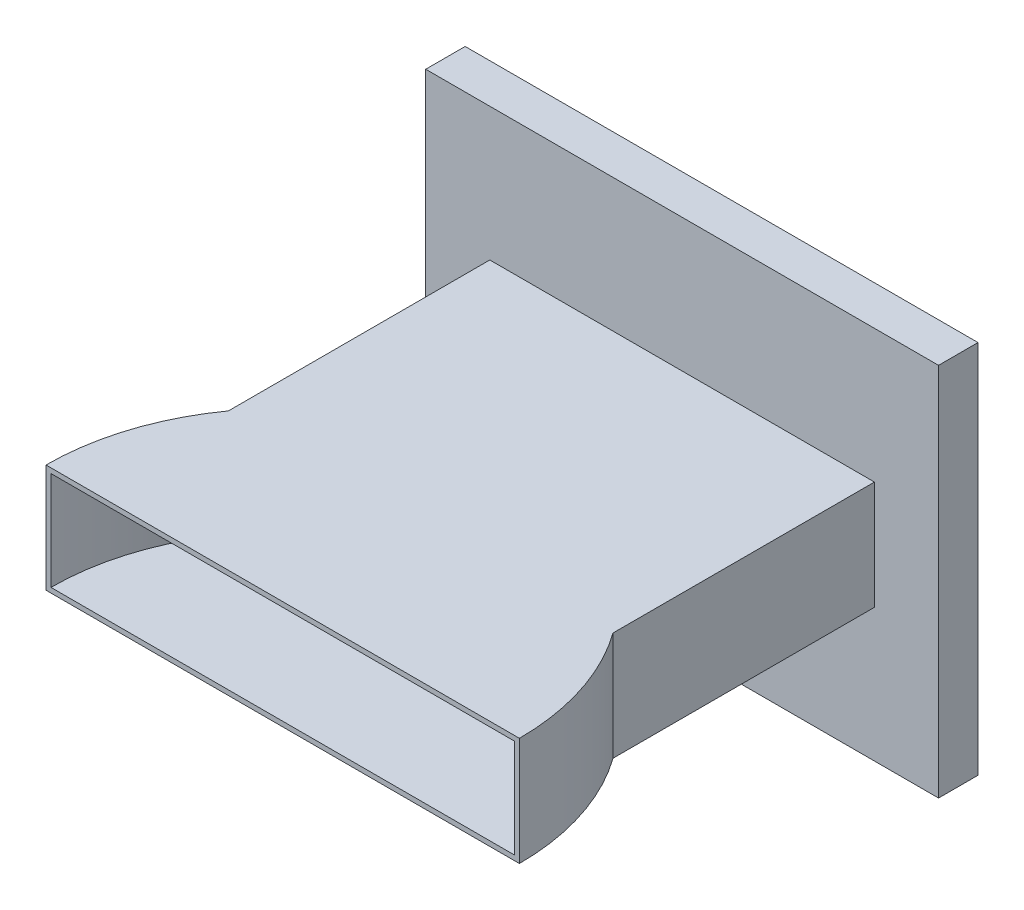
ISO-10303-21;
HEADER;
FILE_DESCRIPTION(('STEP AP214'),'2;1');
FILE_NAME('part.step','',(''),(''),'','','');
FILE_SCHEMA(('AUTOMOTIVE_DESIGN { 1 0 10303 214 1 1 1 1 }'));
ENDSEC;
DATA;
#1=APPLICATION_CONTEXT('core data for automotive mechanical design processes');
#2=APPLICATION_PROTOCOL_DEFINITION('international standard','automotive_design',2000,#1);
#3=PRODUCT_CONTEXT('',#1,'mechanical');
#4=PRODUCT('Part','Part','',(#3));
#5=PRODUCT_RELATED_PRODUCT_CATEGORY('part','',(#4));
#6=PRODUCT_DEFINITION_FORMATION('','',#4);
#7=PRODUCT_DEFINITION_CONTEXT('part definition',#1,'design');
#8=PRODUCT_DEFINITION('design','',#6,#7);
#9=PRODUCT_DEFINITION_SHAPE('','',#8);
#10=(LENGTH_UNIT() NAMED_UNIT(*) SI_UNIT(.MILLI.,.METRE.));
#11=(NAMED_UNIT(*) PLANE_ANGLE_UNIT() SI_UNIT($,.RADIAN.));
#12=(NAMED_UNIT(*) SI_UNIT($,.STERADIAN.) SOLID_ANGLE_UNIT());
#13=UNCERTAINTY_MEASURE_WITH_UNIT(LENGTH_MEASURE(1.E-05),#10,'distance_accuracy_value','');
#14=(GEOMETRIC_REPRESENTATION_CONTEXT(3) GLOBAL_UNCERTAINTY_ASSIGNED_CONTEXT((#13)) GLOBAL_UNIT_ASSIGNED_CONTEXT((#10,
#11,#12)) REPRESENTATION_CONTEXT('',''));
#15=CARTESIAN_POINT('',(0.,0.,0.));
#16=DIRECTION('',(0.,0.,1.));
#17=DIRECTION('',(1.,0.,0.));
#18=AXIS2_PLACEMENT_3D('',#15,#16,#17);
#19=CARTESIAN_POINT('',(0.,0.,243.));
#20=DIRECTION('',(0.,0.,1.));
#21=DIRECTION('',(1.,0.,0.));
#22=AXIS2_PLACEMENT_3D('',#19,#20,#21);
#23=PLANE('',#22);
#24=DIRECTION('',(1.,0.,0.));
#25=VECTOR('',#24,1.);
#26=CARTESIAN_POINT('',(0.,0.,243.));
#27=LINE('',#26,#25);
#28=CARTESIAN_POINT('',(-27.,0.,243.));
#29=VERTEX_POINT('',#28);
#30=CARTESIAN_POINT('',(261.,0.,243.));
#31=VERTEX_POINT('',#30);
#32=EDGE_CURVE('E286',#29,#31,#27,.T.);
#33=ORIENTED_EDGE('',*,*,#32,.T.);
#34=DIRECTION('',(0.,-1.,0.));
#35=VECTOR('',#34,1.);
#36=CARTESIAN_POINT('',(261.,66.,243.));
#37=LINE('',#36,#35);
#38=CARTESIAN_POINT('',(261.,66.,243.));
#39=VERTEX_POINT('',#38);
#40=EDGE_CURVE('E222',#39,#31,#37,.T.);
#41=ORIENTED_EDGE('',*,*,#40,.F.);
#42=DIRECTION('',(-1.,0.,0.));
#43=VECTOR('',#42,1.);
#44=CARTESIAN_POINT('',(234.,66.,243.));
#45=LINE('',#44,#43);
#46=CARTESIAN_POINT('',(-27.,66.,243.));
#47=VERTEX_POINT('',#46);
#48=EDGE_CURVE('E283',#39,#47,#45,.T.);
#49=ORIENTED_EDGE('',*,*,#48,.T.);
#50=DIRECTION('',(0.,-1.,0.));
#51=VECTOR('',#50,1.);
#52=CARTESIAN_POINT('',(-27.,66.,243.));
#53=LINE('',#52,#51);
#54=EDGE_CURVE('E227',#47,#29,#53,.T.);
#55=ORIENTED_EDGE('',*,*,#54,.T.);
#56=EDGE_LOOP('',(#33,#41,#49,#55));
#57=FACE_BOUND('',#56,.T.);
#58=DIRECTION('',(0.,1.,0.));
#59=VECTOR('',#58,1.);
#60=CARTESIAN_POINT('',(-24.,63.,243.));
#61=LINE('',#60,#59);
#62=CARTESIAN_POINT('',(-24.,3.00000000000001,243.));
#63=VERTEX_POINT('',#62);
#64=CARTESIAN_POINT('',(-24.,63.,243.));
#65=VERTEX_POINT('',#64);
#66=EDGE_CURVE('E325',#63,#65,#61,.T.);
#67=ORIENTED_EDGE('',*,*,#66,.T.);
#68=DIRECTION('',(1.,0.,0.));
#69=VECTOR('',#68,1.);
#70=CARTESIAN_POINT('',(0.,63.,243.));
#71=LINE('',#70,#69);
#72=CARTESIAN_POINT('',(258.,63.,243.));
#73=VERTEX_POINT('',#72);
#74=EDGE_CURVE('E11',#65,#73,#71,.T.);
#75=ORIENTED_EDGE('',*,*,#74,.T.);
#76=DIRECTION('',(0.,1.,0.));
#77=VECTOR('',#76,1.);
#78=CARTESIAN_POINT('',(258.,63.,243.));
#79=LINE('',#78,#77);
#80=CARTESIAN_POINT('',(258.,3.00000000000001,243.));
#81=VERTEX_POINT('',#80);
#82=EDGE_CURVE('E50',#73,#81,#79,.F.);
#83=ORIENTED_EDGE('',*,*,#82,.T.);
#84=DIRECTION('',(-1.,0.,0.));
#85=VECTOR('',#84,1.);
#86=CARTESIAN_POINT('',(0.,3.00000000000001,243.));
#87=LINE('',#86,#85);
#88=EDGE_CURVE('E321',#81,#63,#87,.T.);
#89=ORIENTED_EDGE('',*,*,#88,.T.);
#90=EDGE_LOOP('',(#67,#75,#83,#89));
#91=FACE_BOUND('',#90,.T.);
#92=ADVANCED_FACE('F40',(#57,#91),#23,.T.);
#93=CARTESIAN_POINT('',(234.,0.,243.));
#94=DIRECTION('',(-1.,0.,0.));
#95=DIRECTION('',(0.,0.,1.));
#96=AXIS2_PLACEMENT_3D('',#93,#94,#95);
#97=PLANE('',#96);
#98=DIRECTION('',(0.,0.,-1.));
#99=VECTOR('',#98,1.);
#100=CARTESIAN_POINT('',(234.,66.,243.));
#101=LINE('',#100,#99);
#102=CARTESIAN_POINT('',(234.,66.,159.053588522201));
#103=VERTEX_POINT('',#102);
#104=CARTESIAN_POINT('',(234.,66.,0.));
#105=VERTEX_POINT('',#104);
#106=EDGE_CURVE('E64',#103,#105,#101,.T.);
#107=ORIENTED_EDGE('',*,*,#106,.F.);
#108=DIRECTION('',(0.,-1.,0.));
#109=VECTOR('',#108,1.);
#110=CARTESIAN_POINT('',(234.,66.,159.053588522201));
#111=LINE('',#110,#109);
#112=CARTESIAN_POINT('',(234.,0.,159.053588522201));
#113=VERTEX_POINT('',#112);
#114=EDGE_CURVE('E250',#103,#113,#111,.T.);
#115=ORIENTED_EDGE('',*,*,#114,.T.);
#116=DIRECTION('',(0.,0.,-1.));
#117=VECTOR('',#116,1.);
#118=CARTESIAN_POINT('',(234.,0.,243.));
#119=LINE('',#118,#117);
#120=CARTESIAN_POINT('',(234.,0.,0.));
#121=VERTEX_POINT('',#120);
#122=EDGE_CURVE('E290',#113,#121,#119,.T.);
#123=ORIENTED_EDGE('',*,*,#122,.T.);
#124=DIRECTION('',(0.,1.,0.));
#125=VECTOR('',#124,1.);
#126=CARTESIAN_POINT('',(234.,0.,0.));
#127=LINE('',#126,#125);
#128=EDGE_CURVE('E282',#121,#105,#127,.T.);
#129=ORIENTED_EDGE('',*,*,#128,.T.);
#130=EDGE_LOOP('',(#107,#115,#123,#129));
#131=FACE_BOUND('',#130,.T.);
#132=ADVANCED_FACE('F42',(#131),#97,.F.);
#133=CARTESIAN_POINT('',(234.,66.,243.));
#134=DIRECTION('',(0.,-1.,0.));
#135=DIRECTION('',(1.,0.,0.));
#136=AXIS2_PLACEMENT_3D('',#133,#134,#135);
#137=PLANE('',#136);
#138=DIRECTION('',(0.,0.,-1.));
#139=VECTOR('',#138,1.);
#140=CARTESIAN_POINT('',(0.,66.,243.));
#141=LINE('',#140,#139);
#142=CARTESIAN_POINT('',(0.,66.,159.053588522201));
#143=VERTEX_POINT('',#142);
#144=CARTESIAN_POINT('',(0.,66.,0.));
#145=VERTEX_POINT('',#144);
#146=EDGE_CURVE('E311',#143,#145,#141,.T.);
#147=ORIENTED_EDGE('',*,*,#146,.F.);
#148=CARTESIAN_POINT('',(117.,66.,243.));
#149=DIRECTION('',(0.,-1.,0.));
#150=DIRECTION('',(0.,0.,-1.));
#151=AXIS2_PLACEMENT_3D('',#148,#149,#150);
#152=CIRCLE('',#151,144.);
#153=EDGE_CURVE('E219',#47,#143,#152,.T.);
#154=ORIENTED_EDGE('',*,*,#153,.F.);
#155=ORIENTED_EDGE('',*,*,#48,.F.);
#156=EDGE_CURVE('E223',#103,#39,#152,.T.);
#157=ORIENTED_EDGE('',*,*,#156,.F.);
#158=ORIENTED_EDGE('',*,*,#106,.T.);
#159=DIRECTION('',(-1.,0.,0.));
#160=VECTOR('',#159,1.);
#161=CARTESIAN_POINT('',(234.,66.,0.));
#162=LINE('',#161,#160);
#163=EDGE_CURVE('E293',#105,#145,#162,.T.);
#164=ORIENTED_EDGE('',*,*,#163,.T.);
#165=EDGE_LOOP('',(#147,#154,#155,#157,#158,#164));
#166=FACE_BOUND('',#165,.T.);
#167=ADVANCED_FACE('F352',(#166),#137,.F.);
#168=CARTESIAN_POINT('',(0.,66.,243.));
#169=DIRECTION('',(1.,0.,0.));
#170=DIRECTION('',(0.,1.,0.));
#171=AXIS2_PLACEMENT_3D('',#168,#169,#170);
#172=PLANE('',#171);
#173=DIRECTION('',(0.,0.,-1.));
#174=VECTOR('',#173,1.);
#175=CARTESIAN_POINT('',(0.,0.,243.));
#176=LINE('',#175,#174);
#177=CARTESIAN_POINT('',(0.,0.,159.053588522201));
#178=VERTEX_POINT('',#177);
#179=CARTESIAN_POINT('',(0.,0.,0.));
#180=VERTEX_POINT('',#179);
#181=EDGE_CURVE('E307',#178,#180,#176,.T.);
#182=ORIENTED_EDGE('',*,*,#181,.F.);
#183=DIRECTION('',(0.,-1.,0.));
#184=VECTOR('',#183,1.);
#185=CARTESIAN_POINT('',(0.,66.,159.053588522201));
#186=LINE('',#185,#184);
#187=EDGE_CURVE('E246',#178,#143,#186,.F.);
#188=ORIENTED_EDGE('',*,*,#187,.T.);
#189=ORIENTED_EDGE('',*,*,#146,.T.);
#190=DIRECTION('',(0.,-1.,0.));
#191=VECTOR('',#190,1.);
#192=CARTESIAN_POINT('',(0.,66.,0.));
#193=LINE('',#192,#191);
#194=EDGE_CURVE('E297',#145,#180,#193,.T.);
#195=ORIENTED_EDGE('',*,*,#194,.T.);
#196=EDGE_LOOP('',(#182,#188,#189,#195));
#197=FACE_BOUND('',#196,.T.);
#198=ADVANCED_FACE('F361',(#197),#172,.F.);
#199=CARTESIAN_POINT('',(0.,0.,243.));
#200=DIRECTION('',(0.,1.,0.));
#201=DIRECTION('',(0.,0.,1.));
#202=AXIS2_PLACEMENT_3D('',#199,#200,#201);
#203=PLANE('',#202);
#204=ORIENTED_EDGE('',*,*,#122,.F.);
#205=CARTESIAN_POINT('',(117.,0.,243.));
#206=DIRECTION('',(0.,-1.,0.));
#207=DIRECTION('',(0.,0.,-1.));
#208=AXIS2_PLACEMENT_3D('',#205,#206,#207);
#209=CIRCLE('',#208,144.);
#210=EDGE_CURVE('E218',#113,#31,#209,.T.);
#211=ORIENTED_EDGE('',*,*,#210,.T.);
#212=ORIENTED_EDGE('',*,*,#32,.F.);
#213=EDGE_CURVE('E224',#29,#178,#209,.T.);
#214=ORIENTED_EDGE('',*,*,#213,.T.);
#215=ORIENTED_EDGE('',*,*,#181,.T.);
#216=DIRECTION('',(1.,0.,0.));
#217=VECTOR('',#216,1.);
#218=CARTESIAN_POINT('',(0.,0.,0.));
#219=LINE('',#218,#217);
#220=EDGE_CURVE('E287',#180,#121,#219,.T.);
#221=ORIENTED_EDGE('',*,*,#220,.T.);
#222=EDGE_LOOP('',(#204,#211,#212,#214,#215,#221));
#223=FACE_BOUND('',#222,.T.);
#224=ADVANCED_FACE('F357',(#223),#203,.F.);
#225=CARTESIAN_POINT('',(117.,66.,243.));
#226=DIRECTION('',(0.,-1.,0.));
#227=DIRECTION('',(0.,0.,-1.));
#228=AXIS2_PLACEMENT_3D('',#225,#226,#227);
#229=CYLINDRICAL_SURFACE('',#228,144.);
#230=ORIENTED_EDGE('',*,*,#187,.F.);
#231=ORIENTED_EDGE('',*,*,#213,.F.);
#232=ORIENTED_EDGE('',*,*,#54,.F.);
#233=ORIENTED_EDGE('',*,*,#153,.T.);
#234=EDGE_LOOP('',(#230,#231,#232,#233));
#235=FACE_BOUND('',#234,.T.);
#236=ADVANCED_FACE('F360',(#235),#229,.T.);
#237=ORIENTED_EDGE('',*,*,#114,.F.);
#238=ORIENTED_EDGE('',*,*,#156,.T.);
#239=ORIENTED_EDGE('',*,*,#40,.T.);
#240=ORIENTED_EDGE('',*,*,#210,.F.);
#241=EDGE_LOOP('',(#237,#238,#239,#240));
#242=FACE_BOUND('',#241,.T.);
#243=ADVANCED_FACE('F344',(#242),#229,.T.);
#244=CARTESIAN_POINT('',(117.,63.,243.));
#245=DIRECTION('',(0.,1.,0.));
#246=DIRECTION('',(0.,0.,1.));
#247=AXIS2_PLACEMENT_3D('',#244,#245,#246);
#248=CYLINDRICAL_SURFACE('',#247,141.);
#249=CARTESIAN_POINT('',(117.,63.,243.));
#250=DIRECTION('',(0.,1.,0.));
#251=DIRECTION('',(0.,0.,1.));
#252=AXIS2_PLACEMENT_3D('',#249,#250,#251);
#253=CIRCLE('',#252,141.);
#254=EDGE_CURVE('E214',#73,#65,#253,.T.);
#255=ORIENTED_EDGE('',*,*,#254,.T.);
#256=ORIENTED_EDGE('',*,*,#66,.F.);
#257=CARTESIAN_POINT('',(117.,3.00000000000001,243.));
#258=DIRECTION('',(0.,1.,0.));
#259=DIRECTION('',(0.,0.,1.));
#260=AXIS2_PLACEMENT_3D('',#257,#258,#259);
#261=CIRCLE('',#260,141.);
#262=EDGE_CURVE('E56',#81,#63,#261,.T.);
#263=ORIENTED_EDGE('',*,*,#262,.F.);
#264=ORIENTED_EDGE('',*,*,#82,.F.);
#265=EDGE_LOOP('',(#255,#256,#263,#264));
#266=FACE_BOUND('',#265,.T.);
#267=ADVANCED_FACE('F333',(#266),#248,.F.);
#268=CARTESIAN_POINT('',(117.,63.,243.));
#269=DIRECTION('',(0.,-1.,0.));
#270=DIRECTION('',(0.,0.,-1.));
#271=AXIS2_PLACEMENT_3D('',#268,#269,#270);
#272=PLANE('',#271);
#273=ORIENTED_EDGE('',*,*,#254,.F.);
#274=ORIENTED_EDGE('',*,*,#74,.F.);
#275=EDGE_LOOP('',(#273,#274));
#276=FACE_BOUND('',#275,.T.);
#277=ADVANCED_FACE('F335',(#276),#272,.T.);
#278=CARTESIAN_POINT('',(117.,3.00000000000001,243.));
#279=DIRECTION('',(0.,1.,0.));
#280=DIRECTION('',(0.,0.,1.));
#281=AXIS2_PLACEMENT_3D('',#278,#279,#280);
#282=PLANE('',#281);
#283=ORIENTED_EDGE('',*,*,#262,.T.);
#284=ORIENTED_EDGE('',*,*,#88,.F.);
#285=EDGE_LOOP('',(#283,#284));
#286=FACE_BOUND('',#285,.T.);
#287=ADVANCED_FACE('F337',(#286),#282,.T.);
#288=CARTESIAN_POINT('',(-39.,-81.,0.));
#289=DIRECTION('',(0.,0.,1.));
#290=DIRECTION('',(1.,0.,0.));
#291=AXIS2_PLACEMENT_3D('',#288,#289,#290);
#292=PLANE('',#291);
#293=DIRECTION('',(0.,1.,0.));
#294=VECTOR('',#293,1.);
#295=CARTESIAN_POINT('',(273.,-81.,0.));
#296=LINE('',#295,#294);
#297=CARTESIAN_POINT('',(273.,-81.,0.));
#298=VERTEX_POINT('',#297);
#299=CARTESIAN_POINT('',(273.,147.,0.));
#300=VERTEX_POINT('',#299);
#301=EDGE_CURVE('E168',#298,#300,#296,.T.);
#302=ORIENTED_EDGE('',*,*,#301,.T.);
#303=DIRECTION('',(1.,0.,0.));
#304=VECTOR('',#303,1.);
#305=CARTESIAN_POINT('',(-39.,147.,0.));
#306=LINE('',#305,#304);
#307=CARTESIAN_POINT('',(-39.,147.,0.));
#308=VERTEX_POINT('',#307);
#309=EDGE_CURVE('E172',#308,#300,#306,.T.);
#310=ORIENTED_EDGE('',*,*,#309,.F.);
#311=DIRECTION('',(0.,1.,0.));
#312=VECTOR('',#311,1.);
#313=CARTESIAN_POINT('',(-39.,-81.,0.));
#314=LINE('',#313,#312);
#315=CARTESIAN_POINT('',(-39.,-81.,0.));
#316=VERTEX_POINT('',#315);
#317=EDGE_CURVE('E157',#316,#308,#314,.T.);
#318=ORIENTED_EDGE('',*,*,#317,.F.);
#319=DIRECTION('',(1.,0.,0.));
#320=VECTOR('',#319,1.);
#321=CARTESIAN_POINT('',(-39.,-81.,0.));
#322=LINE('',#321,#320);
#323=EDGE_CURVE('E194',#316,#298,#322,.T.);
#324=ORIENTED_EDGE('',*,*,#323,.T.);
#325=EDGE_LOOP('',(#302,#310,#318,#324));
#326=FACE_BOUND('',#325,.T.);
#327=ORIENTED_EDGE('',*,*,#128,.F.);
#328=ORIENTED_EDGE('',*,*,#220,.F.);
#329=ORIENTED_EDGE('',*,*,#194,.F.);
#330=ORIENTED_EDGE('',*,*,#163,.F.);
#331=EDGE_LOOP('',(#327,#328,#329,#330));
#332=FACE_BOUND('',#331,.T.);
#333=ADVANCED_FACE('F173',(#326,#332),#292,.T.);
#334=CARTESIAN_POINT('',(-39.,-81.,0.));
#335=DIRECTION('',(-1.,0.,0.));
#336=DIRECTION('',(0.,0.,1.));
#337=AXIS2_PLACEMENT_3D('',#334,#335,#336);
#338=PLANE('',#337);
#339=ORIENTED_EDGE('',*,*,#317,.T.);
#340=DIRECTION('',(0.,0.,1.));
#341=VECTOR('',#340,1.);
#342=CARTESIAN_POINT('',(-39.,147.,0.));
#343=LINE('',#342,#341);
#344=CARTESIAN_POINT('',(-39.,147.,-24.));
#345=VERTEX_POINT('',#344);
#346=EDGE_CURVE('E161',#345,#308,#343,.T.);
#347=ORIENTED_EDGE('',*,*,#346,.F.);
#348=DIRECTION('',(0.,1.,0.));
#349=VECTOR('',#348,1.);
#350=CARTESIAN_POINT('',(-39.,-81.,-24.));
#351=LINE('',#350,#349);
#352=CARTESIAN_POINT('',(-39.,-81.,-24.));
#353=VERTEX_POINT('',#352);
#354=EDGE_CURVE('E204',#353,#345,#351,.T.);
#355=ORIENTED_EDGE('',*,*,#354,.F.);
#356=DIRECTION('',(0.,0.,1.));
#357=VECTOR('',#356,1.);
#358=CARTESIAN_POINT('',(-39.,-81.,0.));
#359=LINE('',#358,#357);
#360=EDGE_CURVE('E163',#353,#316,#359,.T.);
#361=ORIENTED_EDGE('',*,*,#360,.T.);
#362=EDGE_LOOP('',(#339,#347,#355,#361));
#363=FACE_BOUND('',#362,.T.);
#364=ADVANCED_FACE('F159',(#363),#338,.T.);
#365=CARTESIAN_POINT('',(-39.,-81.,-24.));
#366=DIRECTION('',(0.,0.,-1.));
#367=DIRECTION('',(-1.,0.,0.));
#368=AXIS2_PLACEMENT_3D('',#365,#366,#367);
#369=PLANE('',#368);
#370=ORIENTED_EDGE('',*,*,#354,.T.);
#371=DIRECTION('',(-1.,0.,0.));
#372=VECTOR('',#371,1.);
#373=CARTESIAN_POINT('',(-39.,147.,-24.));
#374=LINE('',#373,#372);
#375=CARTESIAN_POINT('',(273.,147.,-24.));
#376=VERTEX_POINT('',#375);
#377=EDGE_CURVE('E184',#376,#345,#374,.T.);
#378=ORIENTED_EDGE('',*,*,#377,.F.);
#379=DIRECTION('',(0.,1.,0.));
#380=VECTOR('',#379,1.);
#381=CARTESIAN_POINT('',(273.,-81.,-24.));
#382=LINE('',#381,#380);
#383=CARTESIAN_POINT('',(273.,-81.,-24.));
#384=VERTEX_POINT('',#383);
#385=EDGE_CURVE('E207',#384,#376,#382,.T.);
#386=ORIENTED_EDGE('',*,*,#385,.F.);
#387=DIRECTION('',(-1.,0.,0.));
#388=VECTOR('',#387,1.);
#389=CARTESIAN_POINT('',(-39.,-81.,-24.));
#390=LINE('',#389,#388);
#391=EDGE_CURVE('E169',#384,#353,#390,.T.);
#392=ORIENTED_EDGE('',*,*,#391,.T.);
#393=EDGE_LOOP('',(#370,#378,#386,#392));
#394=FACE_BOUND('',#393,.T.);
#395=ADVANCED_FACE('F390',(#394),#369,.T.);
#396=CARTESIAN_POINT('',(273.,-81.,0.));
#397=DIRECTION('',(1.,0.,0.));
#398=DIRECTION('',(0.,0.,-1.));
#399=AXIS2_PLACEMENT_3D('',#396,#397,#398);
#400=PLANE('',#399);
#401=ORIENTED_EDGE('',*,*,#385,.T.);
#402=DIRECTION('',(0.,0.,-1.));
#403=VECTOR('',#402,1.);
#404=CARTESIAN_POINT('',(273.,147.,0.));
#405=LINE('',#404,#403);
#406=EDGE_CURVE('E179',#300,#376,#405,.T.);
#407=ORIENTED_EDGE('',*,*,#406,.F.);
#408=ORIENTED_EDGE('',*,*,#301,.F.);
#409=DIRECTION('',(0.,0.,-1.));
#410=VECTOR('',#409,1.);
#411=CARTESIAN_POINT('',(273.,-81.,0.));
#412=LINE('',#411,#410);
#413=EDGE_CURVE('E197',#298,#384,#412,.T.);
#414=ORIENTED_EDGE('',*,*,#413,.T.);
#415=EDGE_LOOP('',(#401,#407,#408,#414));
#416=FACE_BOUND('',#415,.T.);
#417=ADVANCED_FACE('F508',(#416),#400,.T.);
#418=CARTESIAN_POINT('',(0.,-81.,0.));
#419=DIRECTION('',(0.,-1.,0.));
#420=DIRECTION('',(0.,0.,-1.));
#421=AXIS2_PLACEMENT_3D('',#418,#419,#420);
#422=PLANE('',#421);
#423=ORIENTED_EDGE('',*,*,#360,.F.);
#424=ORIENTED_EDGE('',*,*,#391,.F.);
#425=ORIENTED_EDGE('',*,*,#413,.F.);
#426=ORIENTED_EDGE('',*,*,#323,.F.);
#427=EDGE_LOOP('',(#423,#424,#425,#426));
#428=FACE_BOUND('',#427,.T.);
#429=ADVANCED_FACE('F518',(#428),#422,.T.);
#430=CARTESIAN_POINT('',(0.,147.,0.));
#431=DIRECTION('',(0.,-1.,0.));
#432=DIRECTION('',(0.,0.,-1.));
#433=AXIS2_PLACEMENT_3D('',#430,#431,#432);
#434=PLANE('',#433);
#435=ORIENTED_EDGE('',*,*,#346,.T.);
#436=ORIENTED_EDGE('',*,*,#309,.T.);
#437=ORIENTED_EDGE('',*,*,#406,.T.);
#438=ORIENTED_EDGE('',*,*,#377,.T.);
#439=EDGE_LOOP('',(#435,#436,#437,#438));
#440=FACE_BOUND('',#439,.T.);
#441=ADVANCED_FACE('F182',(#440),#434,.F.);
#442=CLOSED_SHELL('',(#92,#132,#167,#198,#224,#236,#243,#267,#277,#287,#333,#364,#395,#417,#429,#441));
#443=DIRECTION('',(-1.,0.,0.));
#444=VECTOR('',#443,1.);
#445=CARTESIAN_POINT('',(231.,63.,0.));
#446=LINE('',#445,#444);
#447=CARTESIAN_POINT('',(231.,63.,0.));
#448=VERTEX_POINT('',#447);
#449=CARTESIAN_POINT('',(3.,63.,0.));
#450=VERTEX_POINT('',#449);
#451=EDGE_CURVE('E265',#448,#450,#446,.T.);
#452=ORIENTED_EDGE('',*,*,#451,.T.);
#453=DIRECTION('',(0.,-1.,0.));
#454=VECTOR('',#453,1.);
#455=CARTESIAN_POINT('',(3.,63.,0.));
#456=LINE('',#455,#454);
#457=CARTESIAN_POINT('',(3.00000000000001,3.,0.));
#458=VERTEX_POINT('',#457);
#459=EDGE_CURVE('E253',#450,#458,#456,.T.);
#460=ORIENTED_EDGE('',*,*,#459,.T.);
#461=DIRECTION('',(1.,0.,0.));
#462=VECTOR('',#461,1.);
#463=CARTESIAN_POINT('',(3.00000000000001,3.,0.));
#464=LINE('',#463,#462);
#465=CARTESIAN_POINT('',(231.,3.,0.));
#466=VERTEX_POINT('',#465);
#467=EDGE_CURVE('E257',#458,#466,#464,.T.);
#468=ORIENTED_EDGE('',*,*,#467,.T.);
#469=DIRECTION('',(0.,1.,0.));
#470=VECTOR('',#469,1.);
#471=CARTESIAN_POINT('',(231.,3.,0.));
#472=LINE('',#471,#470);
#473=EDGE_CURVE('E261',#466,#448,#472,.T.);
#474=ORIENTED_EDGE('',*,*,#473,.T.);
#475=EDGE_LOOP('',(#452,#460,#468,#474));
#476=FACE_BOUND('',#475,.T.);
#477=ADVANCED_FACE('F386',(#476),#292,.T.);
#478=CARTESIAN_POINT('',(117.,3.,243.));
#479=DIRECTION('',(0.,1.,0.));
#480=DIRECTION('',(0.,0.,1.));
#481=AXIS2_PLACEMENT_3D('',#478,#479,#480);
#482=CIRCLE('',#481,144.);
#483=CARTESIAN_POINT('',(231.,3.,155.022730208309));
#484=VERTEX_POINT('',#483);
#485=CARTESIAN_POINT('',(3.,3.,155.022730208309));
#486=VERTEX_POINT('',#485);
#487=EDGE_CURVE('E238',#484,#486,#482,.T.);
#488=ORIENTED_EDGE('',*,*,#487,.T.);
#489=DIRECTION('',(0.,-1.,0.));
#490=VECTOR('',#489,1.);
#491=CARTESIAN_POINT('',(3.,66.,155.022730208309));
#492=LINE('',#491,#490);
#493=CARTESIAN_POINT('',(3.,63.,155.022730208309));
#494=VERTEX_POINT('',#493);
#495=EDGE_CURVE('E242',#486,#494,#492,.F.);
#496=ORIENTED_EDGE('',*,*,#495,.T.);
#497=CARTESIAN_POINT('',(117.,63.,243.));
#498=DIRECTION('',(0.,-1.,0.));
#499=DIRECTION('',(1.,0.,0.));
#500=AXIS2_PLACEMENT_3D('',#497,#498,#499);
#501=CIRCLE('',#500,144.);
#502=CARTESIAN_POINT('',(231.,63.,155.022730208309));
#503=VERTEX_POINT('',#502);
#504=EDGE_CURVE('E317',#494,#503,#501,.T.);
#505=ORIENTED_EDGE('',*,*,#504,.T.);
#506=DIRECTION('',(0.,-1.,0.));
#507=VECTOR('',#506,1.);
#508=CARTESIAN_POINT('',(231.,66.,155.022730208309));
#509=LINE('',#508,#507);
#510=EDGE_CURVE('E231',#503,#484,#509,.T.);
#511=ORIENTED_EDGE('',*,*,#510,.T.);
#512=EDGE_LOOP('',(#488,#496,#505,#511));
#513=FACE_BOUND('',#512,.T.);
#514=ADVANCED_FACE('F394',(#513),#229,.T.);
#515=CARTESIAN_POINT('',(231.,63.,243.));
#516=DIRECTION('',(0.,-1.,0.));
#517=DIRECTION('',(1.,0.,0.));
#518=AXIS2_PLACEMENT_3D('',#515,#516,#517);
#519=PLANE('',#518);
#520=ORIENTED_EDGE('',*,*,#504,.F.);
#521=DIRECTION('',(0.,0.,-1.));
#522=VECTOR('',#521,1.);
#523=CARTESIAN_POINT('',(3.,63.,243.));
#524=LINE('',#523,#522);
#525=EDGE_CURVE('E269',#494,#450,#524,.T.);
#526=ORIENTED_EDGE('',*,*,#525,.T.);
#527=ORIENTED_EDGE('',*,*,#451,.F.);
#528=DIRECTION('',(0.,0.,-1.));
#529=VECTOR('',#528,1.);
#530=CARTESIAN_POINT('',(231.,63.,243.));
#531=LINE('',#530,#529);
#532=EDGE_CURVE('E273',#503,#448,#531,.T.);
#533=ORIENTED_EDGE('',*,*,#532,.F.);
#534=EDGE_LOOP('',(#520,#526,#527,#533));
#535=FACE_BOUND('',#534,.T.);
#536=ADVANCED_FACE('F401',(#535),#519,.T.);
#537=CARTESIAN_POINT('',(231.,3.,243.));
#538=DIRECTION('',(-1.,0.,0.));
#539=DIRECTION('',(0.,0.,1.));
#540=AXIS2_PLACEMENT_3D('',#537,#538,#539);
#541=PLANE('',#540);
#542=ORIENTED_EDGE('',*,*,#510,.F.);
#543=ORIENTED_EDGE('',*,*,#532,.T.);
#544=ORIENTED_EDGE('',*,*,#473,.F.);
#545=DIRECTION('',(0.,0.,-1.));
#546=VECTOR('',#545,1.);
#547=CARTESIAN_POINT('',(231.,3.,243.));
#548=LINE('',#547,#546);
#549=EDGE_CURVE('E276',#484,#466,#548,.T.);
#550=ORIENTED_EDGE('',*,*,#549,.F.);
#551=EDGE_LOOP('',(#542,#543,#544,#550));
#552=FACE_BOUND('',#551,.T.);
#553=ADVANCED_FACE('F416',(#552),#541,.T.);
#554=CARTESIAN_POINT('',(3.00000000000001,3.,243.));
#555=DIRECTION('',(0.,1.,0.));
#556=DIRECTION('',(0.,0.,1.));
#557=AXIS2_PLACEMENT_3D('',#554,#555,#556);
#558=PLANE('',#557);
#559=ORIENTED_EDGE('',*,*,#487,.F.);
#560=ORIENTED_EDGE('',*,*,#549,.T.);
#561=ORIENTED_EDGE('',*,*,#467,.F.);
#562=DIRECTION('',(0.,0.,-1.));
#563=VECTOR('',#562,1.);
#564=CARTESIAN_POINT('',(3.00000000000001,3.,243.));
#565=LINE('',#564,#563);
#566=EDGE_CURVE('E279',#486,#458,#565,.T.);
#567=ORIENTED_EDGE('',*,*,#566,.F.);
#568=EDGE_LOOP('',(#559,#560,#561,#567));
#569=FACE_BOUND('',#568,.T.);
#570=ADVANCED_FACE('F413',(#569),#558,.T.);
#571=CARTESIAN_POINT('',(3.,63.,243.));
#572=DIRECTION('',(1.,0.,0.));
#573=DIRECTION('',(0.,1.,0.));
#574=AXIS2_PLACEMENT_3D('',#571,#572,#573);
#575=PLANE('',#574);
#576=ORIENTED_EDGE('',*,*,#495,.F.);
#577=ORIENTED_EDGE('',*,*,#566,.T.);
#578=ORIENTED_EDGE('',*,*,#459,.F.);
#579=ORIENTED_EDGE('',*,*,#525,.F.);
#580=EDGE_LOOP('',(#576,#577,#578,#579));
#581=FACE_BOUND('',#580,.T.);
#582=ADVANCED_FACE('F355',(#581),#575,.T.);
#583=CLOSED_SHELL('',(#477,#514,#536,#553,#570,#582));
#584=ORIENTED_CLOSED_SHELL('',*,#583,.T.);
#585=BREP_WITH_VOIDS('B2',#442,(#584));
#586=ADVANCED_BREP_SHAPE_REPRESENTATION('',(#18,#585),#14);
#587=SHAPE_DEFINITION_REPRESENTATION(#9,#586);
ENDSEC;
END-ISO-10303-21;
